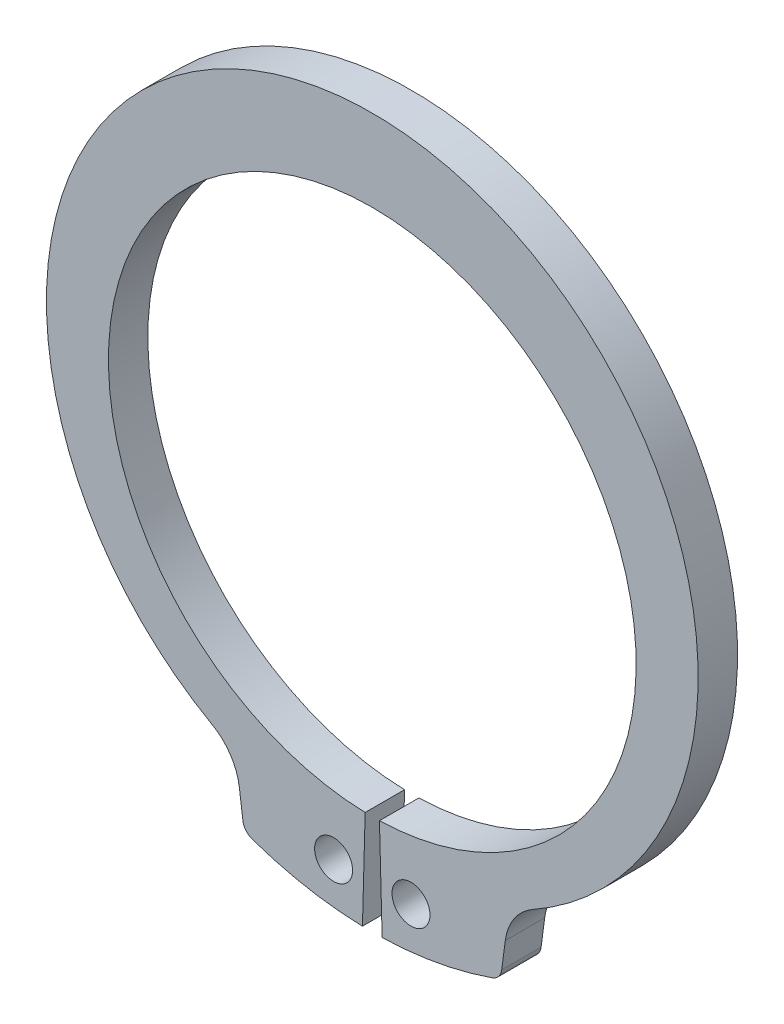
ISO-10303-21;
HEADER;
FILE_DESCRIPTION(('STEP AP214'),'2;1');
FILE_NAME('part.step','',(''),(''),'','','');
FILE_SCHEMA(('AUTOMOTIVE_DESIGN { 1 0 10303 214 1 1 1 1 }'));
ENDSEC;
DATA;
#1=APPLICATION_CONTEXT('core data for automotive mechanical design processes');
#2=APPLICATION_PROTOCOL_DEFINITION('international standard','automotive_design',2000,#1);
#3=PRODUCT_CONTEXT('',#1,'mechanical');
#4=PRODUCT('Part','Part','',(#3));
#5=PRODUCT_RELATED_PRODUCT_CATEGORY('part','',(#4));
#6=PRODUCT_DEFINITION_FORMATION('','',#4);
#7=PRODUCT_DEFINITION_CONTEXT('part definition',#1,'design');
#8=PRODUCT_DEFINITION('design','',#6,#7);
#9=PRODUCT_DEFINITION_SHAPE('','',#8);
#10=(LENGTH_UNIT() NAMED_UNIT(*) SI_UNIT(.MILLI.,.METRE.));
#11=(NAMED_UNIT(*) PLANE_ANGLE_UNIT() SI_UNIT($,.RADIAN.));
#12=(NAMED_UNIT(*) SI_UNIT($,.STERADIAN.) SOLID_ANGLE_UNIT());
#13=UNCERTAINTY_MEASURE_WITH_UNIT(LENGTH_MEASURE(1.E-05),#10,'distance_accuracy_value','');
#14=(GEOMETRIC_REPRESENTATION_CONTEXT(3) GLOBAL_UNCERTAINTY_ASSIGNED_CONTEXT((#13)) GLOBAL_UNIT_ASSIGNED_CONTEXT((#10,
#11,#12)) REPRESENTATION_CONTEXT('',''));
#15=CARTESIAN_POINT('',(0.,0.,0.));
#16=DIRECTION('',(0.,0.,1.));
#17=DIRECTION('',(1.,0.,0.));
#18=AXIS2_PLACEMENT_3D('',#15,#16,#17);
#19=CARTESIAN_POINT('',(0.,0.,-2.8));
#20=DIRECTION('',(0.,0.,1.));
#21=DIRECTION('',(1.,0.,0.));
#22=AXIS2_PLACEMENT_3D('',#19,#20,#21);
#23=CYLINDRICAL_SURFACE('',#22,18.75);
#24=CARTESIAN_POINT('',(0.,0.,0.));
#25=DIRECTION('',(0.,0.,-1.));
#26=DIRECTION('',(1.,0.,0.));
#27=AXIS2_PLACEMENT_3D('',#24,#25,#26);
#28=CIRCLE('',#27,18.75);
#29=CARTESIAN_POINT('',(-0.507736943907157,-18.743124157829,0.));
#30=VERTEX_POINT('',#29);
#31=CARTESIAN_POINT('',(0.507736943907157,-18.743124157829,0.));
#32=VERTEX_POINT('',#31);
#33=EDGE_CURVE('E155',#30,#32,#28,.T.);
#34=ORIENTED_EDGE('',*,*,#33,.F.);
#35=DIRECTION('',(0.,0.,1.));
#36=VECTOR('',#35,1.);
#37=CARTESIAN_POINT('',(-0.507736943907157,-18.743124157829,-2.8));
#38=LINE('',#37,#36);
#39=CARTESIAN_POINT('',(-0.507736943907157,-18.743124157829,-2.8));
#40=VERTEX_POINT('',#39);
#41=EDGE_CURVE('E11',#40,#30,#38,.T.);
#42=ORIENTED_EDGE('',*,*,#41,.F.);
#43=CARTESIAN_POINT('',(0.,0.,-2.8));
#44=DIRECTION('',(0.,0.,-1.));
#45=DIRECTION('',(1.,0.,0.));
#46=AXIS2_PLACEMENT_3D('',#43,#44,#45);
#47=CIRCLE('',#46,18.75);
#48=CARTESIAN_POINT('',(0.507736943907157,-18.743124157829,-2.8));
#49=VERTEX_POINT('',#48);
#50=EDGE_CURVE('E188',#40,#49,#47,.T.);
#51=ORIENTED_EDGE('',*,*,#50,.T.);
#52=DIRECTION('',(0.,0.,1.));
#53=VECTOR('',#52,1.);
#54=CARTESIAN_POINT('',(0.507736943907157,-18.743124157829,-2.8));
#55=LINE('',#54,#53);
#56=EDGE_CURVE('E37',#49,#32,#55,.T.);
#57=ORIENTED_EDGE('',*,*,#56,.T.);
#58=EDGE_LOOP('',(#34,#42,#51,#57));
#59=FACE_BOUND('',#58,.T.);
#60=ADVANCED_FACE('F34',(#59),#23,.F.);
#61=CARTESIAN_POINT('',(-0.507736943907157,-18.743124157829,-2.8));
#62=DIRECTION('',(0.999633288417545,-0.0270793036750483,0.));
#63=DIRECTION('',(0.0270793036750483,0.999633288417545,0.));
#64=AXIS2_PLACEMENT_3D('',#61,#62,#63);
#65=PLANE('',#64);
#66=DIRECTION('',(0.0270793036750484,0.999633288417545,0.));
#67=VECTOR('',#66,1.);
#68=CARTESIAN_POINT('',(-0.507736943907157,-18.743124157829,0.));
#69=LINE('',#68,#67);
#70=CARTESIAN_POINT('',(-0.7,-25.8405205055935,0.));
#71=VERTEX_POINT('',#70);
#72=EDGE_CURVE('E186',#71,#30,#69,.T.);
#73=ORIENTED_EDGE('',*,*,#72,.F.);
#74=DIRECTION('',(0.,0.,1.));
#75=VECTOR('',#74,1.);
#76=CARTESIAN_POINT('',(-0.7,-25.8405205055935,-2.8));
#77=LINE('',#76,#75);
#78=CARTESIAN_POINT('',(-0.7,-25.8405205055935,-2.8));
#79=VERTEX_POINT('',#78);
#80=EDGE_CURVE('E43',#79,#71,#77,.T.);
#81=ORIENTED_EDGE('',*,*,#80,.F.);
#82=DIRECTION('',(0.0270793036750484,0.999633288417545,0.));
#83=VECTOR('',#82,1.);
#84=CARTESIAN_POINT('',(-0.507736943907157,-18.743124157829,-2.8));
#85=LINE('',#84,#83);
#86=EDGE_CURVE('E145',#79,#40,#85,.T.);
#87=ORIENTED_EDGE('',*,*,#86,.T.);
#88=ORIENTED_EDGE('',*,*,#41,.T.);
#89=EDGE_LOOP('',(#73,#81,#87,#88));
#90=FACE_BOUND('',#89,.T.);
#91=ADVANCED_FACE('F208',(#90),#65,.T.);
#92=CARTESIAN_POINT('',(0.,0.,-2.8));
#93=DIRECTION('',(0.,0.,1.));
#94=DIRECTION('',(1.,0.,0.));
#95=AXIS2_PLACEMENT_3D('',#92,#93,#94);
#96=CYLINDRICAL_SURFACE('',#95,25.85);
#97=CARTESIAN_POINT('',(0.,0.,0.));
#98=DIRECTION('',(0.,0.,1.));
#99=DIRECTION('',(1.,0.,0.));
#100=AXIS2_PLACEMENT_3D('',#97,#98,#99);
#101=CIRCLE('',#100,25.85);
#102=CARTESIAN_POINT('',(-8.53324537183457,-24.4009471829285,0.));
#103=VERTEX_POINT('',#102);
#104=EDGE_CURVE('E132',#103,#71,#101,.T.);
#105=ORIENTED_EDGE('',*,*,#104,.F.);
#106=DIRECTION('',(0.,0.,1.));
#107=VECTOR('',#106,1.);
#108=CARTESIAN_POINT('',(-8.53324537183457,-24.4009471829285,-2.8));
#109=LINE('',#108,#107);
#110=CARTESIAN_POINT('',(-8.53324537183457,-24.4009471829285,-2.8));
#111=VERTEX_POINT('',#110);
#112=EDGE_CURVE('E127',#111,#103,#109,.T.);
#113=ORIENTED_EDGE('',*,*,#112,.F.);
#114=CARTESIAN_POINT('',(0.,0.,-2.8));
#115=DIRECTION('',(0.,0.,1.));
#116=DIRECTION('',(1.,0.,0.));
#117=AXIS2_PLACEMENT_3D('',#114,#115,#116);
#118=CIRCLE('',#117,25.85);
#119=EDGE_CURVE('E130',#111,#79,#118,.T.);
#120=ORIENTED_EDGE('',*,*,#119,.T.);
#121=ORIENTED_EDGE('',*,*,#80,.T.);
#122=EDGE_LOOP('',(#105,#113,#120,#121));
#123=FACE_BOUND('',#122,.T.);
#124=ADVANCED_FACE('F129',(#123),#96,.T.);
#125=CARTESIAN_POINT('',(-8.20313916789512,-23.4570033847494,-2.8));
#126=DIRECTION('',(0.,0.,1.));
#127=DIRECTION('',(1.,0.,0.));
#128=AXIS2_PLACEMENT_3D('',#125,#126,#127);
#129=CYLINDRICAL_SURFACE('',#128,0.999999999999999);
#130=CARTESIAN_POINT('',(-8.20313916789512,-23.4570033847494,0.));
#131=DIRECTION('',(0.,0.,1.));
#132=DIRECTION('',(1.,0.,0.));
#133=AXIS2_PLACEMENT_3D('',#130,#131,#132);
#134=CIRCLE('',#133,0.999999999999999);
#135=CARTESIAN_POINT('',(-9.19458402926893,-23.5875295769695,0.));
#136=VERTEX_POINT('',#135);
#137=EDGE_CURVE('E183',#136,#103,#134,.T.);
#138=ORIENTED_EDGE('',*,*,#137,.F.);
#139=DIRECTION('',(0.,0.,1.));
#140=VECTOR('',#139,1.);
#141=CARTESIAN_POINT('',(-9.19458402926893,-23.5875295769695,-2.8));
#142=LINE('',#141,#140);
#143=CARTESIAN_POINT('',(-9.19458402926893,-23.5875295769695,-2.8));
#144=VERTEX_POINT('',#143);
#145=EDGE_CURVE('E137',#144,#136,#142,.T.);
#146=ORIENTED_EDGE('',*,*,#145,.F.);
#147=CARTESIAN_POINT('',(-8.20313916789512,-23.4570033847494,-2.8));
#148=DIRECTION('',(0.,0.,1.));
#149=DIRECTION('',(1.,0.,0.));
#150=AXIS2_PLACEMENT_3D('',#147,#148,#149);
#151=CIRCLE('',#150,0.999999999999999);
#152=EDGE_CURVE('E143',#144,#111,#151,.T.);
#153=ORIENTED_EDGE('',*,*,#152,.T.);
#154=ORIENTED_EDGE('',*,*,#112,.T.);
#155=EDGE_LOOP('',(#138,#146,#153,#154));
#156=FACE_BOUND('',#155,.T.);
#157=ADVANCED_FACE('F147',(#156),#129,.T.);
#158=CARTESIAN_POINT('',(-9.44990097669512,-21.6482048235085,-2.8));
#159=DIRECTION('',(-0.991444861373811,-0.130526192220047,0.));
#160=DIRECTION('',(0.130526192220047,-0.991444861373811,0.));
#161=AXIS2_PLACEMENT_3D('',#158,#159,#160);
#162=PLANE('',#161);
#163=DIRECTION('',(0.130526192220047,-0.991444861373811,0.));
#164=VECTOR('',#163,1.);
#165=CARTESIAN_POINT('',(-9.44990097669512,-21.6482048235085,0.));
#166=LINE('',#165,#164);
#167=CARTESIAN_POINT('',(-9.44990097669512,-21.6482048235085,0.));
#168=VERTEX_POINT('',#167);
#169=EDGE_CURVE('E180',#168,#136,#166,.T.);
#170=ORIENTED_EDGE('',*,*,#169,.F.);
#171=DIRECTION('',(0.,0.,1.));
#172=VECTOR('',#171,1.);
#173=CARTESIAN_POINT('',(-9.44990097669512,-21.6482048235085,-2.8));
#174=LINE('',#173,#172);
#175=CARTESIAN_POINT('',(-9.44990097669512,-21.6482048235085,-2.8));
#176=VERTEX_POINT('',#175);
#177=EDGE_CURVE('E192',#176,#168,#174,.T.);
#178=ORIENTED_EDGE('',*,*,#177,.F.);
#179=DIRECTION('',(0.130526192220047,-0.991444861373811,0.));
#180=VECTOR('',#179,1.);
#181=CARTESIAN_POINT('',(-9.44990097669512,-21.6482048235085,-2.8));
#182=LINE('',#181,#180);
#183=EDGE_CURVE('E148',#176,#144,#182,.T.);
#184=ORIENTED_EDGE('',*,*,#183,.T.);
#185=ORIENTED_EDGE('',*,*,#145,.T.);
#186=EDGE_LOOP('',(#170,#178,#184,#185));
#187=FACE_BOUND('',#186,.T.);
#188=ADVANCED_FACE('F221',(#187),#162,.T.);
#189=CARTESIAN_POINT('',(-13.3149445297659,-22.1570474605543,-2.8));
#190=DIRECTION('',(0.,0.,1.));
#191=DIRECTION('',(1.,0.,0.));
#192=AXIS2_PLACEMENT_3D('',#189,#190,#191);
#193=CYLINDRICAL_SURFACE('',#192,3.89839486153078);
#194=CARTESIAN_POINT('',(-13.3149445297659,-22.1570474605543,0.));
#195=DIRECTION('',(0.,0.,-1.));
#196=DIRECTION('',(1.,0.,0.));
#197=AXIS2_PLACEMENT_3D('',#194,#195,#196);
#198=CIRCLE('',#197,3.89839486153078);
#199=CARTESIAN_POINT('',(-11.3963311283245,-18.7634645291647,0.));
#200=VERTEX_POINT('',#199);
#201=EDGE_CURVE('E177',#200,#168,#198,.T.);
#202=ORIENTED_EDGE('',*,*,#201,.F.);
#203=DIRECTION('',(0.,0.,1.));
#204=VECTOR('',#203,1.);
#205=CARTESIAN_POINT('',(-11.3963311283245,-18.7634645291647,-2.8));
#206=LINE('',#205,#204);
#207=CARTESIAN_POINT('',(-11.3963311283245,-18.7634645291647,-2.8));
#208=VERTEX_POINT('',#207);
#209=EDGE_CURVE('E194',#208,#200,#206,.T.);
#210=ORIENTED_EDGE('',*,*,#209,.F.);
#211=CARTESIAN_POINT('',(-13.3149445297659,-22.1570474605543,-2.8));
#212=DIRECTION('',(0.,0.,-1.));
#213=DIRECTION('',(1.,0.,0.));
#214=AXIS2_PLACEMENT_3D('',#211,#212,#213);
#215=CIRCLE('',#214,3.89839486153078);
#216=EDGE_CURVE('E150',#208,#176,#215,.T.);
#217=ORIENTED_EDGE('',*,*,#216,.T.);
#218=ORIENTED_EDGE('',*,*,#177,.T.);
#219=EDGE_LOOP('',(#202,#210,#217,#218));
#220=FACE_BOUND('',#219,.T.);
#221=ADVANCED_FACE('F224',(#220),#193,.F.);
#222=CARTESIAN_POINT('',(0.,1.39400688664663,-2.8));
#223=DIRECTION('',(0.,0.,1.));
#224=DIRECTION('',(1.,0.,0.));
#225=AXIS2_PLACEMENT_3D('',#222,#223,#224);
#226=CYLINDRICAL_SURFACE('',#225,23.1559931133534);
#227=CARTESIAN_POINT('',(0.,1.39400688664663,0.));
#228=DIRECTION('',(0.,0.,1.));
#229=DIRECTION('',(1.,0.,0.));
#230=AXIS2_PLACEMENT_3D('',#227,#228,#229);
#231=CIRCLE('',#230,23.1559931133534);
#232=CARTESIAN_POINT('',(11.3963311283245,-18.7634645291647,0.));
#233=VERTEX_POINT('',#232);
#234=EDGE_CURVE('E174',#233,#200,#231,.T.);
#235=ORIENTED_EDGE('',*,*,#234,.F.);
#236=DIRECTION('',(0.,0.,1.));
#237=VECTOR('',#236,1.);
#238=CARTESIAN_POINT('',(11.3963311283245,-18.7634645291647,-2.8));
#239=LINE('',#238,#237);
#240=CARTESIAN_POINT('',(11.3963311283245,-18.7634645291647,-2.8));
#241=VERTEX_POINT('',#240);
#242=EDGE_CURVE('E196',#241,#233,#239,.T.);
#243=ORIENTED_EDGE('',*,*,#242,.F.);
#244=CARTESIAN_POINT('',(0.,1.39400688664663,-2.8));
#245=DIRECTION('',(0.,0.,1.));
#246=DIRECTION('',(1.,0.,0.));
#247=AXIS2_PLACEMENT_3D('',#244,#245,#246);
#248=CIRCLE('',#247,23.1559931133534);
#249=EDGE_CURVE('E298',#241,#208,#248,.T.);
#250=ORIENTED_EDGE('',*,*,#249,.T.);
#251=ORIENTED_EDGE('',*,*,#209,.T.);
#252=EDGE_LOOP('',(#235,#243,#250,#251));
#253=FACE_BOUND('',#252,.T.);
#254=ADVANCED_FACE('F228',(#253),#226,.T.);
#255=CARTESIAN_POINT('',(13.3149445297659,-22.1570474605543,-2.8));
#256=DIRECTION('',(0.,0.,1.));
#257=DIRECTION('',(1.,0.,0.));
#258=AXIS2_PLACEMENT_3D('',#255,#256,#257);
#259=CYLINDRICAL_SURFACE('',#258,3.89839486153078);
#260=CARTESIAN_POINT('',(13.3149445297659,-22.1570474605543,0.));
#261=DIRECTION('',(0.,0.,-1.));
#262=DIRECTION('',(1.,0.,0.));
#263=AXIS2_PLACEMENT_3D('',#260,#261,#262);
#264=CIRCLE('',#263,3.89839486153078);
#265=CARTESIAN_POINT('',(9.44990097669513,-21.6482048235085,0.));
#266=VERTEX_POINT('',#265);
#267=EDGE_CURVE('E171',#266,#233,#264,.T.);
#268=ORIENTED_EDGE('',*,*,#267,.F.);
#269=DIRECTION('',(0.,0.,1.));
#270=VECTOR('',#269,1.);
#271=CARTESIAN_POINT('',(9.44990097669513,-21.6482048235085,-2.8));
#272=LINE('',#271,#270);
#273=CARTESIAN_POINT('',(9.44990097669513,-21.6482048235085,-2.8));
#274=VERTEX_POINT('',#273);
#275=EDGE_CURVE('E198',#274,#266,#272,.T.);
#276=ORIENTED_EDGE('',*,*,#275,.F.);
#277=CARTESIAN_POINT('',(13.3149445297659,-22.1570474605543,-2.8));
#278=DIRECTION('',(0.,0.,-1.));
#279=DIRECTION('',(1.,0.,0.));
#280=AXIS2_PLACEMENT_3D('',#277,#278,#279);
#281=CIRCLE('',#280,3.89839486153078);
#282=EDGE_CURVE('E295',#274,#241,#281,.T.);
#283=ORIENTED_EDGE('',*,*,#282,.T.);
#284=ORIENTED_EDGE('',*,*,#242,.T.);
#285=EDGE_LOOP('',(#268,#276,#283,#284));
#286=FACE_BOUND('',#285,.T.);
#287=ADVANCED_FACE('F232',(#286),#259,.F.);
#288=CARTESIAN_POINT('',(9.44990097669513,-21.6482048235085,-2.8));
#289=DIRECTION('',(0.991444861373811,-0.130526192220049,0.));
#290=DIRECTION('',(0.130526192220049,0.991444861373811,0.));
#291=AXIS2_PLACEMENT_3D('',#288,#289,#290);
#292=PLANE('',#291);
#293=DIRECTION('',(0.130526192220049,0.991444861373811,0.));
#294=VECTOR('',#293,1.);
#295=CARTESIAN_POINT('',(9.44990097669513,-21.6482048235085,0.));
#296=LINE('',#295,#294);
#297=CARTESIAN_POINT('',(9.19458402926893,-23.5875295769695,0.));
#298=VERTEX_POINT('',#297);
#299=EDGE_CURVE('E168',#298,#266,#296,.T.);
#300=ORIENTED_EDGE('',*,*,#299,.F.);
#301=DIRECTION('',(0.,0.,1.));
#302=VECTOR('',#301,1.);
#303=CARTESIAN_POINT('',(9.19458402926893,-23.5875295769695,-2.8));
#304=LINE('',#303,#302);
#305=CARTESIAN_POINT('',(9.19458402926893,-23.5875295769695,-2.8));
#306=VERTEX_POINT('',#305);
#307=EDGE_CURVE('E200',#306,#298,#304,.T.);
#308=ORIENTED_EDGE('',*,*,#307,.F.);
#309=DIRECTION('',(0.130526192220049,0.991444861373811,0.));
#310=VECTOR('',#309,1.);
#311=CARTESIAN_POINT('',(9.44990097669513,-21.6482048235085,-2.8));
#312=LINE('',#311,#310);
#313=EDGE_CURVE('E292',#306,#274,#312,.T.);
#314=ORIENTED_EDGE('',*,*,#313,.T.);
#315=ORIENTED_EDGE('',*,*,#275,.T.);
#316=EDGE_LOOP('',(#300,#308,#314,#315));
#317=FACE_BOUND('',#316,.T.);
#318=ADVANCED_FACE('F236',(#317),#292,.T.);
#319=CARTESIAN_POINT('',(8.20313916789512,-23.4570033847494,-2.8));
#320=DIRECTION('',(0.,0.,1.));
#321=DIRECTION('',(1.,0.,0.));
#322=AXIS2_PLACEMENT_3D('',#319,#320,#321);
#323=CYLINDRICAL_SURFACE('',#322,0.999999999999999);
#324=CARTESIAN_POINT('',(8.20313916789512,-23.4570033847494,0.));
#325=DIRECTION('',(0.,0.,1.));
#326=DIRECTION('',(-1.,0.,0.));
#327=AXIS2_PLACEMENT_3D('',#324,#325,#326);
#328=CIRCLE('',#327,0.999999999999999);
#329=CARTESIAN_POINT('',(8.53324537183456,-24.4009471829285,0.));
#330=VERTEX_POINT('',#329);
#331=EDGE_CURVE('E165',#330,#298,#328,.T.);
#332=ORIENTED_EDGE('',*,*,#331,.F.);
#333=DIRECTION('',(0.,0.,1.));
#334=VECTOR('',#333,1.);
#335=CARTESIAN_POINT('',(8.53324537183456,-24.4009471829285,-2.8));
#336=LINE('',#335,#334);
#337=CARTESIAN_POINT('',(8.53324537183456,-24.4009471829285,-2.8));
#338=VERTEX_POINT('',#337);
#339=EDGE_CURVE('E202',#338,#330,#336,.T.);
#340=ORIENTED_EDGE('',*,*,#339,.F.);
#341=CARTESIAN_POINT('',(8.20313916789512,-23.4570033847494,-2.8));
#342=DIRECTION('',(0.,0.,1.));
#343=DIRECTION('',(-1.,0.,0.));
#344=AXIS2_PLACEMENT_3D('',#341,#342,#343);
#345=CIRCLE('',#344,0.999999999999999);
#346=EDGE_CURVE('E289',#338,#306,#345,.T.);
#347=ORIENTED_EDGE('',*,*,#346,.T.);
#348=ORIENTED_EDGE('',*,*,#307,.T.);
#349=EDGE_LOOP('',(#332,#340,#347,#348));
#350=FACE_BOUND('',#349,.T.);
#351=ADVANCED_FACE('F240',(#350),#323,.T.);
#352=CARTESIAN_POINT('',(0.,0.,-2.8));
#353=DIRECTION('',(0.,0.,1.));
#354=DIRECTION('',(1.,0.,0.));
#355=AXIS2_PLACEMENT_3D('',#352,#353,#354);
#356=CYLINDRICAL_SURFACE('',#355,25.85);
#357=CARTESIAN_POINT('',(0.,0.,0.));
#358=DIRECTION('',(0.,0.,1.));
#359=DIRECTION('',(1.,0.,0.));
#360=AXIS2_PLACEMENT_3D('',#357,#358,#359);
#361=CIRCLE('',#360,25.85);
#362=CARTESIAN_POINT('',(0.699999999999987,-25.8405205055935,0.));
#363=VERTEX_POINT('',#362);
#364=EDGE_CURVE('E162',#363,#330,#361,.T.);
#365=ORIENTED_EDGE('',*,*,#364,.F.);
#366=DIRECTION('',(0.,0.,1.));
#367=VECTOR('',#366,1.);
#368=CARTESIAN_POINT('',(0.699999999999987,-25.8405205055935,-2.8));
#369=LINE('',#368,#367);
#370=CARTESIAN_POINT('',(0.699999999999987,-25.8405205055935,-2.8));
#371=VERTEX_POINT('',#370);
#372=EDGE_CURVE('E203',#371,#363,#369,.T.);
#373=ORIENTED_EDGE('',*,*,#372,.F.);
#374=CARTESIAN_POINT('',(0.,0.,-2.8));
#375=DIRECTION('',(0.,0.,1.));
#376=DIRECTION('',(1.,0.,0.));
#377=AXIS2_PLACEMENT_3D('',#374,#375,#376);
#378=CIRCLE('',#377,25.85);
#379=EDGE_CURVE('E286',#371,#338,#378,.T.);
#380=ORIENTED_EDGE('',*,*,#379,.T.);
#381=ORIENTED_EDGE('',*,*,#339,.T.);
#382=EDGE_LOOP('',(#365,#373,#380,#381));
#383=FACE_BOUND('',#382,.T.);
#384=ADVANCED_FACE('F244',(#383),#356,.T.);
#385=CARTESIAN_POINT('',(0.507736943907157,-18.743124157829,-2.8));
#386=DIRECTION('',(-0.999633288417545,-0.0270793036750483,0.));
#387=DIRECTION('',(0.0270793036750483,-0.999633288417545,0.));
#388=AXIS2_PLACEMENT_3D('',#385,#386,#387);
#389=PLANE('',#388);
#390=DIRECTION('',(0.0270793036750484,-0.999633288417545,0.));
#391=VECTOR('',#390,1.);
#392=CARTESIAN_POINT('',(0.507736943907157,-18.743124157829,0.));
#393=LINE('',#392,#391);
#394=EDGE_CURVE('E158',#32,#363,#393,.T.);
#395=ORIENTED_EDGE('',*,*,#394,.F.);
#396=ORIENTED_EDGE('',*,*,#56,.F.);
#397=DIRECTION('',(0.0270793036750484,-0.999633288417545,0.));
#398=VECTOR('',#397,1.);
#399=CARTESIAN_POINT('',(0.507736943907157,-18.743124157829,-2.8));
#400=LINE('',#399,#398);
#401=EDGE_CURVE('E284',#49,#371,#400,.T.);
#402=ORIENTED_EDGE('',*,*,#401,.T.);
#403=ORIENTED_EDGE('',*,*,#372,.T.);
#404=EDGE_LOOP('',(#395,#396,#402,#403));
#405=FACE_BOUND('',#404,.T.);
#406=ADVANCED_FACE('F205',(#405),#389,.T.);
#407=CARTESIAN_POINT('',(0.,0.,-2.8));
#408=DIRECTION('',(0.,0.,1.));
#409=DIRECTION('',(1.,0.,0.));
#410=AXIS2_PLACEMENT_3D('',#407,#408,#409);
#411=PLANE('',#410);
#412=CARTESIAN_POINT('',(-2.75,-22.759462317902,-2.8));
#413=DIRECTION('',(0.,0.,1.));
#414=DIRECTION('',(1.,0.,0.));
#415=AXIS2_PLACEMENT_3D('',#412,#413,#414);
#416=CIRCLE('',#415,1.35);
#417=CARTESIAN_POINT('',(-1.4,-22.759462317902,-2.8));
#418=VERTEX_POINT('',#417);
#419=EDGE_CURVE('E271',#418,#418,#416,.T.);
#420=ORIENTED_EDGE('',*,*,#419,.T.);
#421=EDGE_LOOP('',(#420));
#422=FACE_BOUND('',#421,.T.);
#423=CARTESIAN_POINT('',(2.75,-22.759462317902,-2.8));
#424=DIRECTION('',(0.,0.,1.));
#425=DIRECTION('',(1.,0.,0.));
#426=AXIS2_PLACEMENT_3D('',#423,#424,#425);
#427=CIRCLE('',#426,1.35);
#428=CARTESIAN_POINT('',(4.1,-22.759462317902,-2.8));
#429=VERTEX_POINT('',#428);
#430=EDGE_CURVE('E159',#429,#429,#427,.T.);
#431=ORIENTED_EDGE('',*,*,#430,.T.);
#432=EDGE_LOOP('',(#431));
#433=FACE_BOUND('',#432,.T.);
#434=ORIENTED_EDGE('',*,*,#50,.F.);
#435=ORIENTED_EDGE('',*,*,#86,.F.);
#436=ORIENTED_EDGE('',*,*,#119,.F.);
#437=ORIENTED_EDGE('',*,*,#152,.F.);
#438=ORIENTED_EDGE('',*,*,#183,.F.);
#439=ORIENTED_EDGE('',*,*,#216,.F.);
#440=ORIENTED_EDGE('',*,*,#249,.F.);
#441=ORIENTED_EDGE('',*,*,#282,.F.);
#442=ORIENTED_EDGE('',*,*,#313,.F.);
#443=ORIENTED_EDGE('',*,*,#346,.F.);
#444=ORIENTED_EDGE('',*,*,#379,.F.);
#445=ORIENTED_EDGE('',*,*,#401,.F.);
#446=EDGE_LOOP('',(#434,#435,#436,#437,#438,#439,#440,#441,#442,#443,#444,#445));
#447=FACE_BOUND('',#446,.T.);
#448=ADVANCED_FACE('F141',(#422,#433,#447),#411,.F.);
#449=CARTESIAN_POINT('',(0.,0.,0.));
#450=DIRECTION('',(0.,0.,1.));
#451=DIRECTION('',(1.,0.,0.));
#452=AXIS2_PLACEMENT_3D('',#449,#450,#451);
#453=PLANE('',#452);
#454=CARTESIAN_POINT('',(-2.75,-22.759462317902,0.));
#455=DIRECTION('',(0.,0.,1.));
#456=DIRECTION('',(1.,0.,0.));
#457=AXIS2_PLACEMENT_3D('',#454,#455,#456);
#458=CIRCLE('',#457,1.35);
#459=CARTESIAN_POINT('',(-1.4,-22.759462317902,0.));
#460=VERTEX_POINT('',#459);
#461=EDGE_CURVE('E274',#460,#460,#458,.T.);
#462=ORIENTED_EDGE('',*,*,#461,.F.);
#463=EDGE_LOOP('',(#462));
#464=FACE_BOUND('',#463,.T.);
#465=CARTESIAN_POINT('',(2.75,-22.759462317902,0.));
#466=DIRECTION('',(0.,0.,1.));
#467=DIRECTION('',(1.,0.,0.));
#468=AXIS2_PLACEMENT_3D('',#465,#466,#467);
#469=CIRCLE('',#468,1.35);
#470=CARTESIAN_POINT('',(4.1,-22.759462317902,0.));
#471=VERTEX_POINT('',#470);
#472=EDGE_CURVE('E276',#471,#471,#469,.T.);
#473=ORIENTED_EDGE('',*,*,#472,.F.);
#474=EDGE_LOOP('',(#473));
#475=FACE_BOUND('',#474,.T.);
#476=ORIENTED_EDGE('',*,*,#33,.T.);
#477=ORIENTED_EDGE('',*,*,#394,.T.);
#478=ORIENTED_EDGE('',*,*,#364,.T.);
#479=ORIENTED_EDGE('',*,*,#331,.T.);
#480=ORIENTED_EDGE('',*,*,#299,.T.);
#481=ORIENTED_EDGE('',*,*,#267,.T.);
#482=ORIENTED_EDGE('',*,*,#234,.T.);
#483=ORIENTED_EDGE('',*,*,#201,.T.);
#484=ORIENTED_EDGE('',*,*,#169,.T.);
#485=ORIENTED_EDGE('',*,*,#137,.T.);
#486=ORIENTED_EDGE('',*,*,#104,.T.);
#487=ORIENTED_EDGE('',*,*,#72,.T.);
#488=EDGE_LOOP('',(#476,#477,#478,#479,#480,#481,#482,#483,#484,#485,#486,#487));
#489=FACE_BOUND('',#488,.T.);
#490=ADVANCED_FACE('F207',(#464,#475,#489),#453,.T.);
#491=CARTESIAN_POINT('',(2.75,-22.759462317902,-2.8));
#492=DIRECTION('',(0.,0.,1.));
#493=DIRECTION('',(1.,0.,0.));
#494=AXIS2_PLACEMENT_3D('',#491,#492,#493);
#495=CYLINDRICAL_SURFACE('',#494,1.35);
#496=ORIENTED_EDGE('',*,*,#430,.F.);
#497=EDGE_LOOP('',(#496));
#498=FACE_BOUND('',#497,.T.);
#499=ORIENTED_EDGE('',*,*,#472,.T.);
#500=EDGE_LOOP('',(#499));
#501=FACE_BOUND('',#500,.T.);
#502=ADVANCED_FACE('F256',(#498,#501),#495,.F.);
#503=CARTESIAN_POINT('',(-2.75,-22.759462317902,-2.8));
#504=DIRECTION('',(0.,0.,1.));
#505=DIRECTION('',(1.,0.,0.));
#506=AXIS2_PLACEMENT_3D('',#503,#504,#505);
#507=CYLINDRICAL_SURFACE('',#506,1.35);
#508=ORIENTED_EDGE('',*,*,#419,.F.);
#509=EDGE_LOOP('',(#508));
#510=FACE_BOUND('',#509,.T.);
#511=ORIENTED_EDGE('',*,*,#461,.T.);
#512=EDGE_LOOP('',(#511));
#513=FACE_BOUND('',#512,.T.);
#514=ADVANCED_FACE('F263',(#510,#513),#507,.F.);
#515=CLOSED_SHELL('',(#60,#91,#124,#157,#188,#221,#254,#287,#318,#351,#384,#406,#448,#490,#502,#514));
#516=MANIFOLD_SOLID_BREP('B2',#515);
#517=ADVANCED_BREP_SHAPE_REPRESENTATION('',(#18,#516),#14);
#518=SHAPE_DEFINITION_REPRESENTATION(#9,#517);
ENDSEC;
END-ISO-10303-21;
